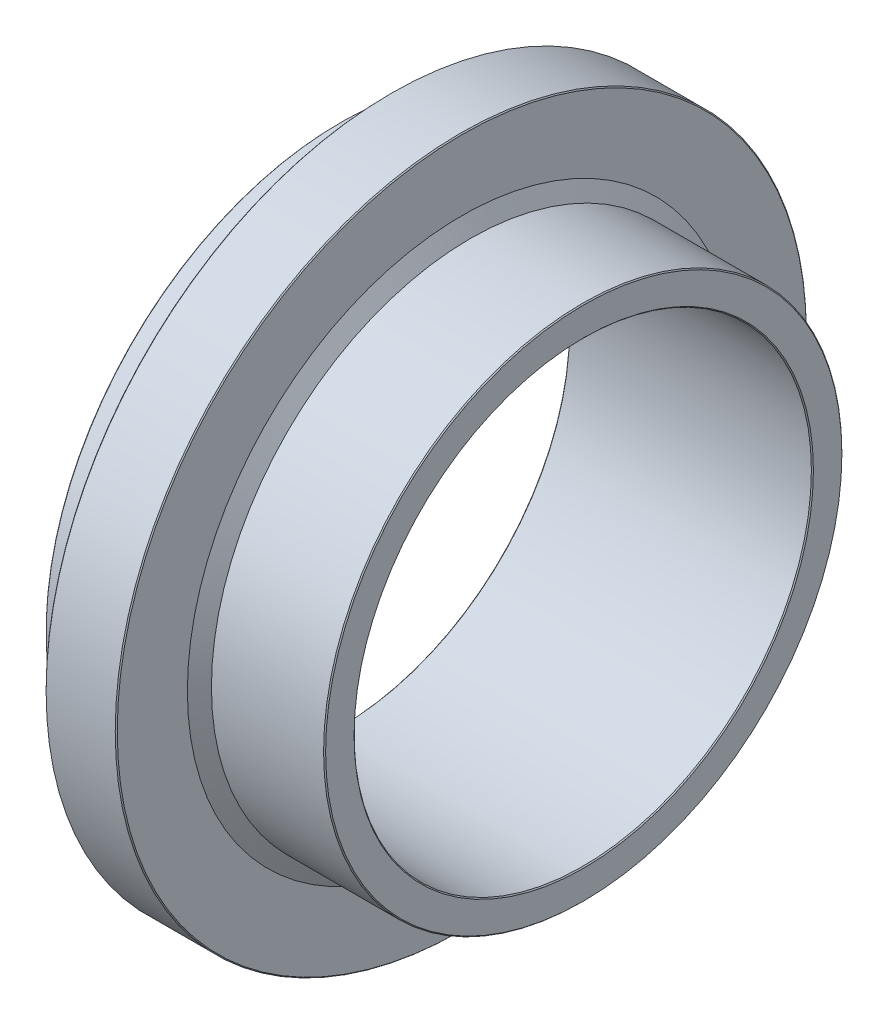
ISO-10303-21;
HEADER;
FILE_DESCRIPTION(('STEP AP214'),'2;1');
FILE_NAME('part.step','',(''),(''),'','','');
FILE_SCHEMA(('AUTOMOTIVE_DESIGN { 1 0 10303 214 1 1 1 1 }'));
ENDSEC;
DATA;
#1=APPLICATION_CONTEXT('core data for automotive mechanical design processes');
#2=APPLICATION_PROTOCOL_DEFINITION('international standard','automotive_design',2000,#1);
#3=PRODUCT_CONTEXT('',#1,'mechanical');
#4=PRODUCT('Part','Part','',(#3));
#5=PRODUCT_RELATED_PRODUCT_CATEGORY('part','',(#4));
#6=PRODUCT_DEFINITION_FORMATION('','',#4);
#7=PRODUCT_DEFINITION_CONTEXT('part definition',#1,'design');
#8=PRODUCT_DEFINITION('design','',#6,#7);
#9=PRODUCT_DEFINITION_SHAPE('','',#8);
#10=(LENGTH_UNIT() NAMED_UNIT(*) SI_UNIT(.MILLI.,.METRE.));
#11=(NAMED_UNIT(*) PLANE_ANGLE_UNIT() SI_UNIT($,.RADIAN.));
#12=(NAMED_UNIT(*) SI_UNIT($,.STERADIAN.) SOLID_ANGLE_UNIT());
#13=UNCERTAINTY_MEASURE_WITH_UNIT(LENGTH_MEASURE(1.E-05),#10,'distance_accuracy_value','');
#14=(GEOMETRIC_REPRESENTATION_CONTEXT(3) GLOBAL_UNCERTAINTY_ASSIGNED_CONTEXT((#13)) GLOBAL_UNIT_ASSIGNED_CONTEXT((#10,
#11,#12)) REPRESENTATION_CONTEXT('',''));
#15=CARTESIAN_POINT('',(0.,0.,0.));
#16=DIRECTION('',(0.,0.,1.));
#17=DIRECTION('',(1.,0.,0.));
#18=AXIS2_PLACEMENT_3D('',#15,#16,#17);
#19=CARTESIAN_POINT('',(-24.,54.,0.));
#20=DIRECTION('',(1.,0.,0.));
#21=DIRECTION('',(0.,0.,-1.));
#22=AXIS2_PLACEMENT_3D('',#19,#20,#21);
#23=PLANE('',#22);
#24=CARTESIAN_POINT('',(-24.,0.,0.));
#25=DIRECTION('',(1.,0.,0.));
#26=DIRECTION('',(0.,0.,-1.));
#27=AXIS2_PLACEMENT_3D('',#24,#25,#26);
#28=CIRCLE('',#27,67.8);
#29=CARTESIAN_POINT('',(-24.,0.,-67.8));
#30=VERTEX_POINT('',#29);
#31=EDGE_CURVE('E10',#30,#30,#28,.T.);
#32=ORIENTED_EDGE('',*,*,#31,.T.);
#33=EDGE_LOOP('',(#32));
#34=FACE_BOUND('',#33,.T.);
#35=CARTESIAN_POINT('',(-24.,0.,0.));
#36=DIRECTION('',(1.,0.,0.));
#37=DIRECTION('',(0.,0.,-1.));
#38=AXIS2_PLACEMENT_3D('',#35,#36,#37);
#39=CIRCLE('',#38,54.);
#40=CARTESIAN_POINT('',(-24.,0.,-54.));
#41=VERTEX_POINT('',#40);
#42=EDGE_CURVE('E80',#41,#41,#39,.T.);
#43=ORIENTED_EDGE('',*,*,#42,.F.);
#44=EDGE_LOOP('',(#43));
#45=FACE_BOUND('',#44,.T.);
#46=ADVANCED_FACE('F31',(#34,#45),#23,.T.);
#47=CARTESIAN_POINT('',(-24.,0.,0.));
#48=DIRECTION('',(-1.,0.,0.));
#49=DIRECTION('',(0.,0.,1.));
#50=AXIS2_PLACEMENT_3D('',#47,#48,#49);
#51=CONICAL_SURFACE('',#50,67.8,0.7853981633975);
#52=CARTESIAN_POINT('',(-24.2,0.,0.));
#53=DIRECTION('',(1.,0.,0.));
#54=DIRECTION('',(0.,0.,-1.));
#55=AXIS2_PLACEMENT_3D('',#52,#53,#54);
#56=CIRCLE('',#55,68.);
#57=CARTESIAN_POINT('',(-24.2,0.,-68.));
#58=VERTEX_POINT('',#57);
#59=EDGE_CURVE('E37',#58,#58,#56,.T.);
#60=ORIENTED_EDGE('',*,*,#59,.T.);
#61=EDGE_LOOP('',(#60));
#62=FACE_BOUND('',#61,.T.);
#63=ORIENTED_EDGE('',*,*,#31,.F.);
#64=EDGE_LOOP('',(#63));
#65=FACE_BOUND('',#64,.T.);
#66=ADVANCED_FACE('F88',(#62,#65),#51,.T.);
#67=CARTESIAN_POINT('',(0.,0.,0.));
#68=DIRECTION('',(1.,0.,0.));
#69=DIRECTION('',(0.,0.,-1.));
#70=AXIS2_PLACEMENT_3D('',#67,#68,#69);
#71=CYLINDRICAL_SURFACE('',#70,68.);
#72=CARTESIAN_POINT('',(-37.8,0.,0.));
#73=DIRECTION('',(1.,0.,0.));
#74=DIRECTION('',(0.,0.,-1.));
#75=AXIS2_PLACEMENT_3D('',#72,#73,#74);
#76=CIRCLE('',#75,68.);
#77=CARTESIAN_POINT('',(-37.8,0.,-68.));
#78=VERTEX_POINT('',#77);
#79=EDGE_CURVE('E41',#78,#78,#76,.T.);
#80=ORIENTED_EDGE('',*,*,#79,.T.);
#81=EDGE_LOOP('',(#80));
#82=FACE_BOUND('',#81,.T.);
#83=ORIENTED_EDGE('',*,*,#59,.F.);
#84=EDGE_LOOP('',(#83));
#85=FACE_BOUND('',#84,.T.);
#86=ADVANCED_FACE('F92',(#82,#85),#71,.T.);
#87=CARTESIAN_POINT('',(-37.8,0.,0.));
#88=DIRECTION('',(1.,0.,0.));
#89=DIRECTION('',(0.,0.,-1.));
#90=AXIS2_PLACEMENT_3D('',#87,#88,#89);
#91=CONICAL_SURFACE('',#90,68.,0.785398163397466);
#92=CARTESIAN_POINT('',(-38.,0.,0.));
#93=DIRECTION('',(1.,0.,0.));
#94=DIRECTION('',(0.,0.,-1.));
#95=AXIS2_PLACEMENT_3D('',#92,#93,#94);
#96=CIRCLE('',#95,67.8);
#97=CARTESIAN_POINT('',(-38.,0.,-67.8));
#98=VERTEX_POINT('',#97);
#99=EDGE_CURVE('E45',#98,#98,#96,.T.);
#100=ORIENTED_EDGE('',*,*,#99,.T.);
#101=EDGE_LOOP('',(#100));
#102=FACE_BOUND('',#101,.T.);
#103=ORIENTED_EDGE('',*,*,#79,.F.);
#104=EDGE_LOOP('',(#103));
#105=FACE_BOUND('',#104,.T.);
#106=ADVANCED_FACE('F96',(#102,#105),#91,.T.);
#107=CARTESIAN_POINT('',(-38.,67.8,0.));
#108=DIRECTION('',(-1.,0.,0.));
#109=DIRECTION('',(0.,0.,1.));
#110=AXIS2_PLACEMENT_3D('',#107,#108,#109);
#111=PLANE('',#110);
#112=CARTESIAN_POINT('',(-38.,0.,0.));
#113=DIRECTION('',(1.,0.,0.));
#114=DIRECTION('',(0.,0.,-1.));
#115=AXIS2_PLACEMENT_3D('',#112,#113,#114);
#116=CIRCLE('',#115,58.);
#117=CARTESIAN_POINT('',(-38.,0.,-58.));
#118=VERTEX_POINT('',#117);
#119=EDGE_CURVE('E50',#118,#118,#116,.T.);
#120=ORIENTED_EDGE('',*,*,#119,.T.);
#121=EDGE_LOOP('',(#120));
#122=FACE_BOUND('',#121,.T.);
#123=ORIENTED_EDGE('',*,*,#99,.F.);
#124=EDGE_LOOP('',(#123));
#125=FACE_BOUND('',#124,.T.);
#126=ADVANCED_FACE('F103',(#122,#125),#111,.T.);
#127=CARTESIAN_POINT('',(0.,0.,0.));
#128=DIRECTION('',(1.,0.,0.));
#129=DIRECTION('',(0.,0.,-1.));
#130=AXIS2_PLACEMENT_3D('',#127,#128,#129);
#131=CYLINDRICAL_SURFACE('',#130,58.);
#132=CARTESIAN_POINT('',(-47.8,0.,0.));
#133=DIRECTION('',(1.,0.,0.));
#134=DIRECTION('',(0.,0.,-1.));
#135=AXIS2_PLACEMENT_3D('',#132,#133,#134);
#136=CIRCLE('',#135,58.);
#137=CARTESIAN_POINT('',(-47.8,0.,-58.));
#138=VERTEX_POINT('',#137);
#139=EDGE_CURVE('E53',#138,#138,#136,.T.);
#140=ORIENTED_EDGE('',*,*,#139,.T.);
#141=EDGE_LOOP('',(#140));
#142=FACE_BOUND('',#141,.T.);
#143=ORIENTED_EDGE('',*,*,#119,.F.);
#144=EDGE_LOOP('',(#143));
#145=FACE_BOUND('',#144,.T.);
#146=ADVANCED_FACE('F107',(#142,#145),#131,.T.);
#147=CARTESIAN_POINT('',(-47.8,0.,0.));
#148=DIRECTION('',(1.,0.,0.));
#149=DIRECTION('',(0.,0.,-1.));
#150=AXIS2_PLACEMENT_3D('',#147,#148,#149);
#151=CONICAL_SURFACE('',#150,58.,0.785398163397483);
#152=CARTESIAN_POINT('',(-48.,0.,0.));
#153=DIRECTION('',(1.,0.,0.));
#154=DIRECTION('',(0.,0.,-1.));
#155=AXIS2_PLACEMENT_3D('',#152,#153,#154);
#156=CIRCLE('',#155,57.8);
#157=CARTESIAN_POINT('',(-48.,0.,-57.8));
#158=VERTEX_POINT('',#157);
#159=EDGE_CURVE('E56',#158,#158,#156,.T.);
#160=ORIENTED_EDGE('',*,*,#159,.T.);
#161=EDGE_LOOP('',(#160));
#162=FACE_BOUND('',#161,.T.);
#163=ORIENTED_EDGE('',*,*,#139,.F.);
#164=EDGE_LOOP('',(#163));
#165=FACE_BOUND('',#164,.T.);
#166=ADVANCED_FACE('F111',(#162,#165),#151,.T.);
#167=CARTESIAN_POINT('',(-48.,57.8,0.));
#168=DIRECTION('',(-1.,0.,0.));
#169=DIRECTION('',(0.,0.,1.));
#170=AXIS2_PLACEMENT_3D('',#167,#168,#169);
#171=PLANE('',#170);
#172=CARTESIAN_POINT('',(-48.,0.,0.));
#173=DIRECTION('',(1.,0.,0.));
#174=DIRECTION('',(0.,0.,-1.));
#175=AXIS2_PLACEMENT_3D('',#172,#173,#174);
#176=CIRCLE('',#175,45.2);
#177=CARTESIAN_POINT('',(-48.,0.,-45.2));
#178=VERTEX_POINT('',#177);
#179=EDGE_CURVE('E59',#178,#178,#176,.T.);
#180=ORIENTED_EDGE('',*,*,#179,.T.);
#181=EDGE_LOOP('',(#180));
#182=FACE_BOUND('',#181,.T.);
#183=ORIENTED_EDGE('',*,*,#159,.F.);
#184=EDGE_LOOP('',(#183));
#185=FACE_BOUND('',#184,.T.);
#186=ADVANCED_FACE('F115',(#182,#185),#171,.T.);
#187=CARTESIAN_POINT('',(-48.,0.,0.));
#188=DIRECTION('',(-1.,0.,0.));
#189=DIRECTION('',(0.,0.,1.));
#190=AXIS2_PLACEMENT_3D('',#187,#188,#189);
#191=CONICAL_SURFACE('',#190,45.2,0.785398163397466);
#192=CARTESIAN_POINT('',(-47.8,0.,0.));
#193=DIRECTION('',(1.,0.,0.));
#194=DIRECTION('',(0.,0.,-1.));
#195=AXIS2_PLACEMENT_3D('',#192,#193,#194);
#196=CIRCLE('',#195,45.);
#197=CARTESIAN_POINT('',(-47.8,0.,-45.));
#198=VERTEX_POINT('',#197);
#199=EDGE_CURVE('E62',#198,#198,#196,.T.);
#200=ORIENTED_EDGE('',*,*,#199,.T.);
#201=EDGE_LOOP('',(#200));
#202=FACE_BOUND('',#201,.T.);
#203=ORIENTED_EDGE('',*,*,#179,.F.);
#204=EDGE_LOOP('',(#203));
#205=FACE_BOUND('',#204,.T.);
#206=ADVANCED_FACE('F119',(#202,#205),#191,.F.);
#207=CARTESIAN_POINT('',(0.,0.,0.));
#208=DIRECTION('',(1.,0.,0.));
#209=DIRECTION('',(0.,0.,-1.));
#210=AXIS2_PLACEMENT_3D('',#207,#208,#209);
#211=CYLINDRICAL_SURFACE('',#210,45.);
#212=CARTESIAN_POINT('',(-0.200000000000001,0.,0.));
#213=DIRECTION('',(1.,0.,0.));
#214=DIRECTION('',(0.,0.,-1.));
#215=AXIS2_PLACEMENT_3D('',#212,#213,#214);
#216=CIRCLE('',#215,45.);
#217=CARTESIAN_POINT('',(-0.200000000000001,0.,-45.));
#218=VERTEX_POINT('',#217);
#219=EDGE_CURVE('E65',#218,#218,#216,.T.);
#220=ORIENTED_EDGE('',*,*,#219,.T.);
#221=EDGE_LOOP('',(#220));
#222=FACE_BOUND('',#221,.T.);
#223=ORIENTED_EDGE('',*,*,#199,.F.);
#224=EDGE_LOOP('',(#223));
#225=FACE_BOUND('',#224,.T.);
#226=ADVANCED_FACE('F123',(#222,#225),#211,.F.);
#227=CARTESIAN_POINT('',(-0.200000000000001,0.,0.));
#228=DIRECTION('',(1.,0.,0.));
#229=DIRECTION('',(0.,0.,-1.));
#230=AXIS2_PLACEMENT_3D('',#227,#228,#229);
#231=CONICAL_SURFACE('',#230,45.,0.785398163397444);
#232=CARTESIAN_POINT('',(0.,0.,0.));
#233=DIRECTION('',(1.,0.,0.));
#234=DIRECTION('',(0.,0.,-1.));
#235=AXIS2_PLACEMENT_3D('',#232,#233,#234);
#236=CIRCLE('',#235,45.2);
#237=CARTESIAN_POINT('',(0.,0.,-45.2));
#238=VERTEX_POINT('',#237);
#239=EDGE_CURVE('E68',#238,#238,#236,.T.);
#240=ORIENTED_EDGE('',*,*,#239,.T.);
#241=EDGE_LOOP('',(#240));
#242=FACE_BOUND('',#241,.T.);
#243=ORIENTED_EDGE('',*,*,#219,.F.);
#244=EDGE_LOOP('',(#243));
#245=FACE_BOUND('',#244,.T.);
#246=ADVANCED_FACE('F127',(#242,#245),#231,.F.);
#247=CARTESIAN_POINT('',(0.,45.2,0.));
#248=DIRECTION('',(1.,0.,0.));
#249=DIRECTION('',(0.,0.,-1.));
#250=AXIS2_PLACEMENT_3D('',#247,#248,#249);
#251=PLANE('',#250);
#252=CARTESIAN_POINT('',(0.,0.,0.));
#253=DIRECTION('',(1.,0.,0.));
#254=DIRECTION('',(0.,0.,-1.));
#255=AXIS2_PLACEMENT_3D('',#252,#253,#254);
#256=CIRCLE('',#255,50.8);
#257=CARTESIAN_POINT('',(0.,0.,-50.8));
#258=VERTEX_POINT('',#257);
#259=EDGE_CURVE('E71',#258,#258,#256,.T.);
#260=ORIENTED_EDGE('',*,*,#259,.T.);
#261=EDGE_LOOP('',(#260));
#262=FACE_BOUND('',#261,.T.);
#263=ORIENTED_EDGE('',*,*,#239,.F.);
#264=EDGE_LOOP('',(#263));
#265=FACE_BOUND('',#264,.T.);
#266=ADVANCED_FACE('F131',(#262,#265),#251,.T.);
#267=CARTESIAN_POINT('',(0.,0.,0.));
#268=DIRECTION('',(-1.,0.,0.));
#269=DIRECTION('',(0.,0.,1.));
#270=AXIS2_PLACEMENT_3D('',#267,#268,#269);
#271=CONICAL_SURFACE('',#270,50.8,0.785398163397447);
#272=CARTESIAN_POINT('',(-0.2,0.,0.));
#273=DIRECTION('',(1.,0.,0.));
#274=DIRECTION('',(0.,0.,-1.));
#275=AXIS2_PLACEMENT_3D('',#272,#273,#274);
#276=CIRCLE('',#275,51.);
#277=CARTESIAN_POINT('',(-0.2,0.,-51.));
#278=VERTEX_POINT('',#277);
#279=EDGE_CURVE('E74',#278,#278,#276,.T.);
#280=ORIENTED_EDGE('',*,*,#279,.T.);
#281=EDGE_LOOP('',(#280));
#282=FACE_BOUND('',#281,.T.);
#283=ORIENTED_EDGE('',*,*,#259,.F.);
#284=EDGE_LOOP('',(#283));
#285=FACE_BOUND('',#284,.T.);
#286=ADVANCED_FACE('F135',(#282,#285),#271,.T.);
#287=CARTESIAN_POINT('',(0.,0.,0.));
#288=DIRECTION('',(1.,0.,0.));
#289=DIRECTION('',(0.,0.,-1.));
#290=AXIS2_PLACEMENT_3D('',#287,#288,#289);
#291=CYLINDRICAL_SURFACE('',#290,51.);
#292=CARTESIAN_POINT('',(-22.2679491924311,0.,0.));
#293=DIRECTION('',(1.,0.,0.));
#294=DIRECTION('',(0.,0.,-1.));
#295=AXIS2_PLACEMENT_3D('',#292,#293,#294);
#296=CIRCLE('',#295,51.);
#297=CARTESIAN_POINT('',(-22.2679491924311,0.,-51.));
#298=VERTEX_POINT('',#297);
#299=EDGE_CURVE('E77',#298,#298,#296,.T.);
#300=ORIENTED_EDGE('',*,*,#299,.T.);
#301=EDGE_LOOP('',(#300));
#302=FACE_BOUND('',#301,.T.);
#303=ORIENTED_EDGE('',*,*,#279,.F.);
#304=EDGE_LOOP('',(#303));
#305=FACE_BOUND('',#304,.T.);
#306=ADVANCED_FACE('F139',(#302,#305),#291,.T.);
#307=CARTESIAN_POINT('',(-22.2679491924311,0.,0.));
#308=DIRECTION('',(-1.,0.,0.));
#309=DIRECTION('',(0.,0.,1.));
#310=AXIS2_PLACEMENT_3D('',#307,#308,#309);
#311=CONICAL_SURFACE('',#310,51.,1.0471975511966);
#312=ORIENTED_EDGE('',*,*,#42,.T.);
#313=EDGE_LOOP('',(#312));
#314=FACE_BOUND('',#313,.T.);
#315=ORIENTED_EDGE('',*,*,#299,.F.);
#316=EDGE_LOOP('',(#315));
#317=FACE_BOUND('',#316,.T.);
#318=ADVANCED_FACE('F84',(#314,#317),#311,.T.);
#319=CLOSED_SHELL('',(#46,#66,#86,#106,#126,#146,#166,#186,#206,#226,#246,#266,#286,#306,#318));
#320=MANIFOLD_SOLID_BREP('B2',#319);
#321=ADVANCED_BREP_SHAPE_REPRESENTATION('',(#18,#320),#14);
#322=SHAPE_DEFINITION_REPRESENTATION(#9,#321);
ENDSEC;
END-ISO-10303-21;
